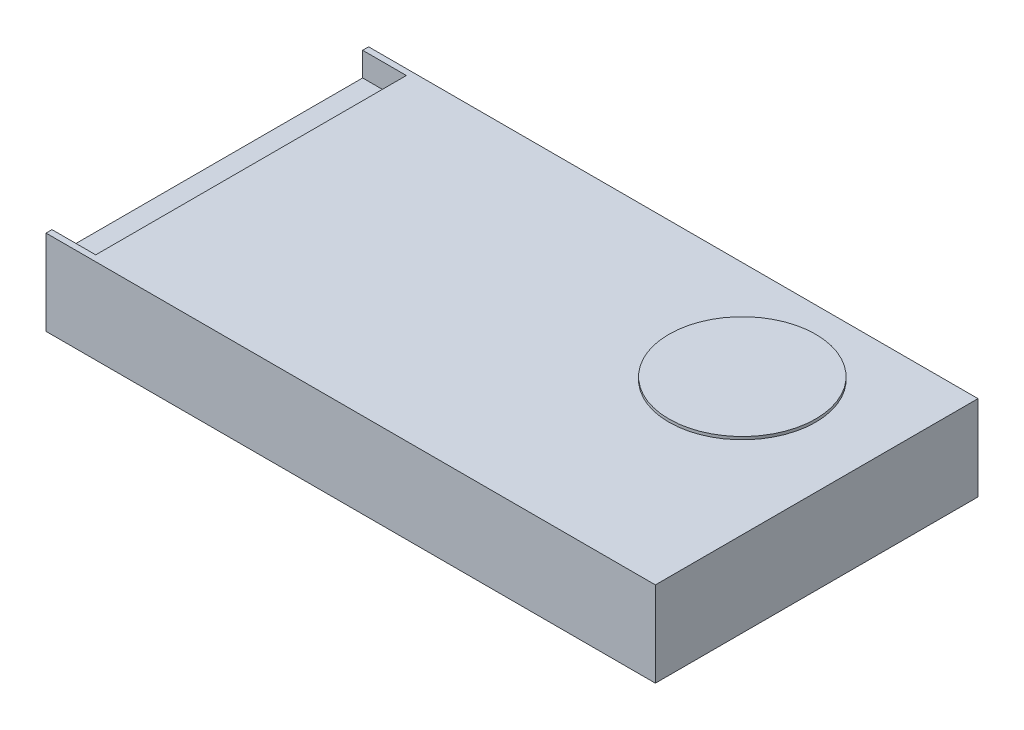
ISO-10303-21;
HEADER;
FILE_DESCRIPTION(('STEP AP214'),'2;1');
FILE_NAME('part.step','',(''),(''),'','','');
FILE_SCHEMA(('AUTOMOTIVE_DESIGN { 1 0 10303 214 1 1 1 1 }'));
ENDSEC;
DATA;
#1=APPLICATION_CONTEXT('core data for automotive mechanical design processes');
#2=APPLICATION_PROTOCOL_DEFINITION('international standard','automotive_design',2000,#1);
#3=PRODUCT_CONTEXT('',#1,'mechanical');
#4=PRODUCT('Part','Part','',(#3));
#5=PRODUCT_RELATED_PRODUCT_CATEGORY('part','',(#4));
#6=PRODUCT_DEFINITION_FORMATION('','',#4);
#7=PRODUCT_DEFINITION_CONTEXT('part definition',#1,'design');
#8=PRODUCT_DEFINITION('design','',#6,#7);
#9=PRODUCT_DEFINITION_SHAPE('','',#8);
#10=(LENGTH_UNIT() NAMED_UNIT(*) SI_UNIT(.MILLI.,.METRE.));
#11=(NAMED_UNIT(*) PLANE_ANGLE_UNIT() SI_UNIT($,.RADIAN.));
#12=(NAMED_UNIT(*) SI_UNIT($,.STERADIAN.) SOLID_ANGLE_UNIT());
#13=UNCERTAINTY_MEASURE_WITH_UNIT(LENGTH_MEASURE(1.E-05),#10,'distance_accuracy_value','');
#14=(GEOMETRIC_REPRESENTATION_CONTEXT(3) GLOBAL_UNCERTAINTY_ASSIGNED_CONTEXT((#13)) GLOBAL_UNIT_ASSIGNED_CONTEXT((#10,
#11,#12)) REPRESENTATION_CONTEXT('',''));
#15=CARTESIAN_POINT('',(0.,0.,0.));
#16=DIRECTION('',(0.,0.,1.));
#17=DIRECTION('',(1.,0.,0.));
#18=AXIS2_PLACEMENT_3D('',#15,#16,#17);
#19=CARTESIAN_POINT('',(0.,30.17,0.));
#20=DIRECTION('',(1.,0.,0.));
#21=DIRECTION('',(0.,0.,-1.));
#22=AXIS2_PLACEMENT_3D('',#19,#20,#21);
#23=PLANE('',#22);
#24=DIRECTION('',(0.,0.,1.));
#25=VECTOR('',#24,1.);
#26=CARTESIAN_POINT('',(0.,21.67,-112.18));
#27=LINE('',#26,#25);
#28=CARTESIAN_POINT('',(0.,21.67,-112.18));
#29=VERTEX_POINT('',#28);
#30=CARTESIAN_POINT('',(0.,21.67,-2.12));
#31=VERTEX_POINT('',#30);
#32=EDGE_CURVE('E115',#29,#31,#27,.T.);
#33=ORIENTED_EDGE('',*,*,#32,.F.);
#34=DIRECTION('',(0.,1.,0.));
#35=VECTOR('',#34,1.);
#36=CARTESIAN_POINT('',(0.,21.67,-112.18));
#37=LINE('',#36,#35);
#38=CARTESIAN_POINT('',(0.,30.17,-112.18));
#39=VERTEX_POINT('',#38);
#40=EDGE_CURVE('E145',#29,#39,#37,.T.);
#41=ORIENTED_EDGE('',*,*,#40,.T.);
#42=DIRECTION('',(0.,0.,1.));
#43=VECTOR('',#42,1.);
#44=CARTESIAN_POINT('',(0.,30.17,0.));
#45=LINE('',#44,#43);
#46=CARTESIAN_POINT('',(0.,30.17,-114.3));
#47=VERTEX_POINT('',#46);
#48=EDGE_CURVE('E133',#47,#39,#45,.T.);
#49=ORIENTED_EDGE('',*,*,#48,.F.);
#50=DIRECTION('',(0.,-1.,0.));
#51=VECTOR('',#50,1.);
#52=CARTESIAN_POINT('',(0.,30.17,-114.3));
#53=LINE('',#52,#51);
#54=CARTESIAN_POINT('',(0.,0.,-114.3));
#55=VERTEX_POINT('',#54);
#56=EDGE_CURVE('E140',#47,#55,#53,.T.);
#57=ORIENTED_EDGE('',*,*,#56,.T.);
#58=DIRECTION('',(0.,0.,1.));
#59=VECTOR('',#58,1.);
#60=CARTESIAN_POINT('',(0.,0.,0.));
#61=LINE('',#60,#59);
#62=CARTESIAN_POINT('',(0.,0.,0.));
#63=VERTEX_POINT('',#62);
#64=EDGE_CURVE('E141',#55,#63,#61,.T.);
#65=ORIENTED_EDGE('',*,*,#64,.T.);
#66=DIRECTION('',(0.,-1.,0.));
#67=VECTOR('',#66,1.);
#68=CARTESIAN_POINT('',(0.,30.17,0.));
#69=LINE('',#68,#67);
#70=CARTESIAN_POINT('',(0.,30.17,0.));
#71=VERTEX_POINT('',#70);
#72=EDGE_CURVE('E42',#71,#63,#69,.T.);
#73=ORIENTED_EDGE('',*,*,#72,.F.);
#74=CARTESIAN_POINT('',(0.,30.17,-2.12));
#75=VERTEX_POINT('',#74);
#76=EDGE_CURVE('E85',#75,#71,#45,.T.);
#77=ORIENTED_EDGE('',*,*,#76,.F.);
#78=DIRECTION('',(0.,1.,0.));
#79=VECTOR('',#78,1.);
#80=CARTESIAN_POINT('',(0.,21.67,-2.12));
#81=LINE('',#80,#79);
#82=EDGE_CURVE('E49',#31,#75,#81,.T.);
#83=ORIENTED_EDGE('',*,*,#82,.F.);
#84=EDGE_LOOP('',(#33,#41,#49,#57,#65,#73,#77,#83));
#85=FACE_BOUND('',#84,.T.);
#86=ADVANCED_FACE('F35',(#85),#23,.F.);
#87=CARTESIAN_POINT('',(0.,30.17,0.));
#88=DIRECTION('',(0.,0.,-1.));
#89=DIRECTION('',(-1.,0.,0.));
#90=AXIS2_PLACEMENT_3D('',#87,#88,#89);
#91=PLANE('',#90);
#92=DIRECTION('',(1.,0.,0.));
#93=VECTOR('',#92,1.);
#94=CARTESIAN_POINT('',(0.,0.,0.));
#95=LINE('',#94,#93);
#96=CARTESIAN_POINT('',(215.9,0.,0.));
#97=VERTEX_POINT('',#96);
#98=EDGE_CURVE('E144',#63,#97,#95,.T.);
#99=ORIENTED_EDGE('',*,*,#98,.T.);
#100=DIRECTION('',(0.,-1.,0.));
#101=VECTOR('',#100,1.);
#102=CARTESIAN_POINT('',(215.9,30.17,0.));
#103=LINE('',#102,#101);
#104=CARTESIAN_POINT('',(215.9,30.17,0.));
#105=VERTEX_POINT('',#104);
#106=EDGE_CURVE('E153',#105,#97,#103,.T.);
#107=ORIENTED_EDGE('',*,*,#106,.F.);
#108=DIRECTION('',(1.,0.,0.));
#109=VECTOR('',#108,1.);
#110=CARTESIAN_POINT('',(0.,30.17,0.));
#111=LINE('',#110,#109);
#112=EDGE_CURVE('E135',#71,#105,#111,.T.);
#113=ORIENTED_EDGE('',*,*,#112,.F.);
#114=ORIENTED_EDGE('',*,*,#72,.T.);
#115=EDGE_LOOP('',(#99,#107,#113,#114));
#116=FACE_BOUND('',#115,.T.);
#117=ADVANCED_FACE('F157',(#116),#91,.F.);
#118=CARTESIAN_POINT('',(215.9,30.17,0.));
#119=DIRECTION('',(-1.,0.,0.));
#120=DIRECTION('',(0.,0.,1.));
#121=AXIS2_PLACEMENT_3D('',#118,#119,#120);
#122=PLANE('',#121);
#123=DIRECTION('',(0.,0.,-1.));
#124=VECTOR('',#123,1.);
#125=CARTESIAN_POINT('',(215.9,0.,0.));
#126=LINE('',#125,#124);
#127=CARTESIAN_POINT('',(215.9,0.,-114.3));
#128=VERTEX_POINT('',#127);
#129=EDGE_CURVE('E147',#97,#128,#126,.T.);
#130=ORIENTED_EDGE('',*,*,#129,.T.);
#131=DIRECTION('',(0.,-1.,0.));
#132=VECTOR('',#131,1.);
#133=CARTESIAN_POINT('',(215.9,30.17,-114.3));
#134=LINE('',#133,#132);
#135=CARTESIAN_POINT('',(215.9,30.17,-114.3));
#136=VERTEX_POINT('',#135);
#137=EDGE_CURVE('E151',#136,#128,#134,.T.);
#138=ORIENTED_EDGE('',*,*,#137,.F.);
#139=DIRECTION('',(0.,0.,-1.));
#140=VECTOR('',#139,1.);
#141=CARTESIAN_POINT('',(215.9,30.17,0.));
#142=LINE('',#141,#140);
#143=EDGE_CURVE('E137',#105,#136,#142,.T.);
#144=ORIENTED_EDGE('',*,*,#143,.F.);
#145=ORIENTED_EDGE('',*,*,#106,.T.);
#146=EDGE_LOOP('',(#130,#138,#144,#145));
#147=FACE_BOUND('',#146,.T.);
#148=ADVANCED_FACE('F166',(#147),#122,.F.);
#149=CARTESIAN_POINT('',(0.,30.17,-114.3));
#150=DIRECTION('',(0.,0.,1.));
#151=DIRECTION('',(1.,0.,0.));
#152=AXIS2_PLACEMENT_3D('',#149,#150,#151);
#153=PLANE('',#152);
#154=DIRECTION('',(-1.,0.,0.));
#155=VECTOR('',#154,1.);
#156=CARTESIAN_POINT('',(0.,0.,-114.3));
#157=LINE('',#156,#155);
#158=EDGE_CURVE('E79',#128,#55,#157,.T.);
#159=ORIENTED_EDGE('',*,*,#158,.T.);
#160=ORIENTED_EDGE('',*,*,#56,.F.);
#161=DIRECTION('',(-1.,0.,0.));
#162=VECTOR('',#161,1.);
#163=CARTESIAN_POINT('',(0.,30.17,-114.3));
#164=LINE('',#163,#162);
#165=EDGE_CURVE('E58',#136,#47,#164,.T.);
#166=ORIENTED_EDGE('',*,*,#165,.F.);
#167=ORIENTED_EDGE('',*,*,#137,.T.);
#168=EDGE_LOOP('',(#159,#160,#166,#167));
#169=FACE_BOUND('',#168,.T.);
#170=ADVANCED_FACE('F168',(#169),#153,.F.);
#171=CARTESIAN_POINT('',(0.,30.17,0.));
#172=DIRECTION('',(0.,-1.,0.));
#173=DIRECTION('',(0.,0.,-1.));
#174=AXIS2_PLACEMENT_3D('',#171,#172,#173);
#175=PLANE('',#174);
#176=CARTESIAN_POINT('',(168.4,30.17,-78.3));
#177=DIRECTION('',(0.,-1.,0.));
#178=DIRECTION('',(0.,0.,-1.));
#179=AXIS2_PLACEMENT_3D('',#176,#177,#178);
#180=CIRCLE('',#179,26.);
#181=CARTESIAN_POINT('',(168.4,30.17,-104.3));
#182=VERTEX_POINT('',#181);
#183=EDGE_CURVE('E11',#182,#182,#180,.F.);
#184=ORIENTED_EDGE('',*,*,#183,.F.);
#185=EDGE_LOOP('',(#184));
#186=FACE_BOUND('',#185,.T.);
#187=ORIENTED_EDGE('',*,*,#48,.T.);
#188=DIRECTION('',(-1.,0.,0.));
#189=VECTOR('',#188,1.);
#190=CARTESIAN_POINT('',(0.,30.17,-112.18));
#191=LINE('',#190,#189);
#192=CARTESIAN_POINT('',(15.4999999999999,30.17,-112.18));
#193=VERTEX_POINT('',#192);
#194=EDGE_CURVE('E124',#193,#39,#191,.T.);
#195=ORIENTED_EDGE('',*,*,#194,.F.);
#196=DIRECTION('',(0.,0.,-1.));
#197=VECTOR('',#196,1.);
#198=CARTESIAN_POINT('',(15.4999999999999,30.17,-112.18));
#199=LINE('',#198,#197);
#200=CARTESIAN_POINT('',(15.5,30.17,-2.12));
#201=VERTEX_POINT('',#200);
#202=EDGE_CURVE('E173',#201,#193,#199,.T.);
#203=ORIENTED_EDGE('',*,*,#202,.F.);
#204=DIRECTION('',(1.,0.,0.));
#205=VECTOR('',#204,1.);
#206=CARTESIAN_POINT('',(0.,30.17,-2.12));
#207=LINE('',#206,#205);
#208=EDGE_CURVE('E176',#75,#201,#207,.T.);
#209=ORIENTED_EDGE('',*,*,#208,.F.);
#210=ORIENTED_EDGE('',*,*,#76,.T.);
#211=ORIENTED_EDGE('',*,*,#112,.T.);
#212=ORIENTED_EDGE('',*,*,#143,.T.);
#213=ORIENTED_EDGE('',*,*,#165,.T.);
#214=EDGE_LOOP('',(#187,#195,#203,#209,#210,#211,#212,#213));
#215=FACE_BOUND('',#214,.T.);
#216=ADVANCED_FACE('F170',(#186,#215),#175,.F.);
#217=CARTESIAN_POINT('',(0.,0.,0.));
#218=DIRECTION('',(0.,-1.,0.));
#219=DIRECTION('',(0.,0.,-1.));
#220=AXIS2_PLACEMENT_3D('',#217,#218,#219);
#221=PLANE('',#220);
#222=ORIENTED_EDGE('',*,*,#64,.F.);
#223=ORIENTED_EDGE('',*,*,#158,.F.);
#224=ORIENTED_EDGE('',*,*,#129,.F.);
#225=ORIENTED_EDGE('',*,*,#98,.F.);
#226=EDGE_LOOP('',(#222,#223,#224,#225));
#227=FACE_BOUND('',#226,.T.);
#228=ADVANCED_FACE('F162',(#227),#221,.T.);
#229=CARTESIAN_POINT('',(0.,21.67,-112.18));
#230=DIRECTION('',(0.,0.,-1.));
#231=DIRECTION('',(-1.,0.,0.));
#232=AXIS2_PLACEMENT_3D('',#229,#230,#231);
#233=PLANE('',#232);
#234=ORIENTED_EDGE('',*,*,#194,.T.);
#235=ORIENTED_EDGE('',*,*,#40,.F.);
#236=DIRECTION('',(-1.,0.,0.));
#237=VECTOR('',#236,1.);
#238=CARTESIAN_POINT('',(0.,21.67,-112.18));
#239=LINE('',#238,#237);
#240=CARTESIAN_POINT('',(15.4999999999999,21.67,-112.18));
#241=VERTEX_POINT('',#240);
#242=EDGE_CURVE('E121',#241,#29,#239,.T.);
#243=ORIENTED_EDGE('',*,*,#242,.F.);
#244=DIRECTION('',(0.,1.,0.));
#245=VECTOR('',#244,1.);
#246=CARTESIAN_POINT('',(15.4999999999999,21.67,-112.18));
#247=LINE('',#246,#245);
#248=EDGE_CURVE('E128',#241,#193,#247,.T.);
#249=ORIENTED_EDGE('',*,*,#248,.T.);
#250=EDGE_LOOP('',(#234,#235,#243,#249));
#251=FACE_BOUND('',#250,.T.);
#252=ADVANCED_FACE('F180',(#251),#233,.F.);
#253=CARTESIAN_POINT('',(15.4999999999999,21.67,-112.18));
#254=DIRECTION('',(1.,0.,0.));
#255=DIRECTION('',(0.,0.,-1.));
#256=AXIS2_PLACEMENT_3D('',#253,#254,#255);
#257=PLANE('',#256);
#258=ORIENTED_EDGE('',*,*,#202,.T.);
#259=ORIENTED_EDGE('',*,*,#248,.F.);
#260=DIRECTION('',(0.,0.,-1.));
#261=VECTOR('',#260,1.);
#262=CARTESIAN_POINT('',(15.4999999999999,21.67,-112.18));
#263=LINE('',#262,#261);
#264=CARTESIAN_POINT('',(15.5,21.67,-2.12));
#265=VERTEX_POINT('',#264);
#266=EDGE_CURVE('E114',#265,#241,#263,.T.);
#267=ORIENTED_EDGE('',*,*,#266,.F.);
#268=DIRECTION('',(0.,1.,0.));
#269=VECTOR('',#268,1.);
#270=CARTESIAN_POINT('',(15.5,21.67,-2.12));
#271=LINE('',#270,#269);
#272=EDGE_CURVE('E110',#265,#201,#271,.T.);
#273=ORIENTED_EDGE('',*,*,#272,.T.);
#274=EDGE_LOOP('',(#258,#259,#267,#273));
#275=FACE_BOUND('',#274,.T.);
#276=ADVANCED_FACE('F182',(#275),#257,.F.);
#277=CARTESIAN_POINT('',(0.,21.67,-2.12));
#278=DIRECTION('',(0.,0.,1.));
#279=DIRECTION('',(1.,0.,0.));
#280=AXIS2_PLACEMENT_3D('',#277,#278,#279);
#281=PLANE('',#280);
#282=ORIENTED_EDGE('',*,*,#208,.T.);
#283=ORIENTED_EDGE('',*,*,#272,.F.);
#284=DIRECTION('',(1.,0.,0.));
#285=VECTOR('',#284,1.);
#286=CARTESIAN_POINT('',(0.,21.67,-2.12));
#287=LINE('',#286,#285);
#288=EDGE_CURVE('E107',#31,#265,#287,.T.);
#289=ORIENTED_EDGE('',*,*,#288,.F.);
#290=ORIENTED_EDGE('',*,*,#82,.T.);
#291=EDGE_LOOP('',(#282,#283,#289,#290));
#292=FACE_BOUND('',#291,.T.);
#293=ADVANCED_FACE('F109',(#292),#281,.F.);
#294=CARTESIAN_POINT('',(0.,21.67,0.));
#295=DIRECTION('',(0.,1.,0.));
#296=DIRECTION('',(0.,0.,1.));
#297=AXIS2_PLACEMENT_3D('',#294,#295,#296);
#298=PLANE('',#297);
#299=ORIENTED_EDGE('',*,*,#32,.T.);
#300=ORIENTED_EDGE('',*,*,#288,.T.);
#301=ORIENTED_EDGE('',*,*,#266,.T.);
#302=ORIENTED_EDGE('',*,*,#242,.T.);
#303=EDGE_LOOP('',(#299,#300,#301,#302));
#304=FACE_BOUND('',#303,.T.);
#305=ADVANCED_FACE('F119',(#304),#298,.T.);
#306=CARTESIAN_POINT('',(168.4,31.17,-78.3));
#307=DIRECTION('',(0.,-1.,0.));
#308=DIRECTION('',(0.,0.,-1.));
#309=AXIS2_PLACEMENT_3D('',#306,#307,#308);
#310=CYLINDRICAL_SURFACE('',#309,26.);
#311=CARTESIAN_POINT('',(168.4,31.17,-78.3));
#312=DIRECTION('',(0.,1.,0.));
#313=DIRECTION('',(0.,0.,1.));
#314=AXIS2_PLACEMENT_3D('',#311,#312,#313);
#315=CIRCLE('',#314,26.);
#316=CARTESIAN_POINT('',(168.4,31.17,-52.3));
#317=VERTEX_POINT('',#316);
#318=EDGE_CURVE('E183',#317,#317,#315,.T.);
#319=ORIENTED_EDGE('',*,*,#318,.F.);
#320=EDGE_LOOP('',(#319));
#321=FACE_BOUND('',#320,.T.);
#322=ORIENTED_EDGE('',*,*,#183,.T.);
#323=EDGE_LOOP('',(#322));
#324=FACE_BOUND('',#323,.T.);
#325=ADVANCED_FACE('F191',(#321,#324),#310,.T.);
#326=CARTESIAN_POINT('',(168.4,31.17,-78.3));
#327=DIRECTION('',(0.,1.,0.));
#328=DIRECTION('',(0.,0.,1.));
#329=AXIS2_PLACEMENT_3D('',#326,#327,#328);
#330=PLANE('',#329);
#331=ORIENTED_EDGE('',*,*,#318,.T.);
#332=EDGE_LOOP('',(#331));
#333=FACE_BOUND('',#332,.T.);
#334=ADVANCED_FACE('F189',(#333),#330,.T.);
#335=CLOSED_SHELL('',(#86,#117,#148,#170,#216,#228,#252,#276,#293,#305,#325,#334));
#336=MANIFOLD_SOLID_BREP('B2',#335);
#337=ADVANCED_BREP_SHAPE_REPRESENTATION('',(#18,#336),#14);
#338=SHAPE_DEFINITION_REPRESENTATION(#9,#337);
ENDSEC;
END-ISO-10303-21;
